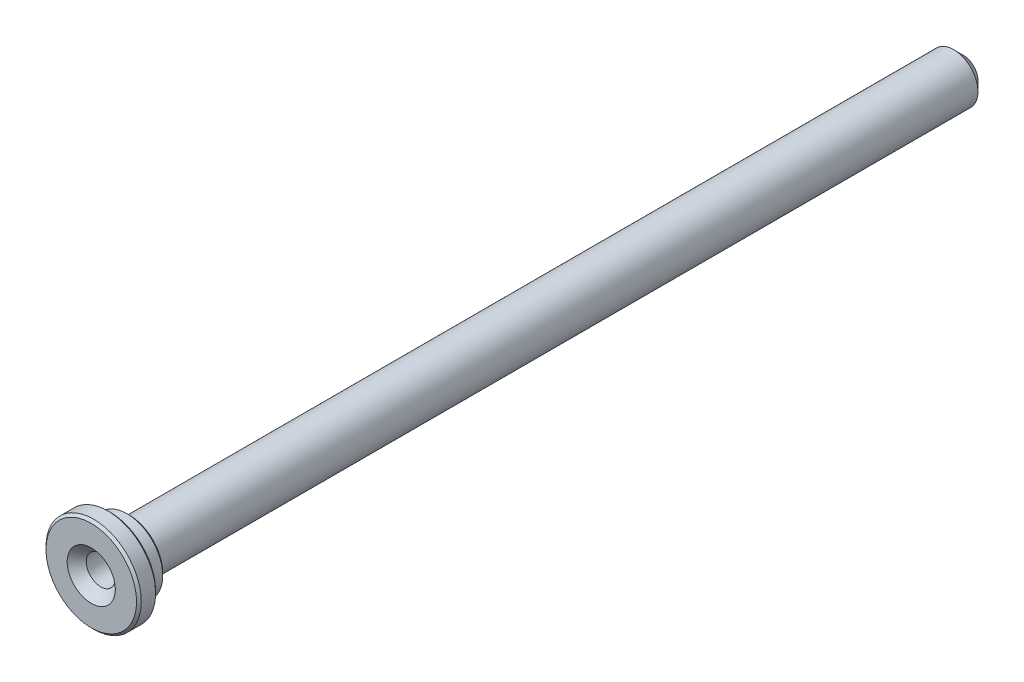
ISO-10303-21;
HEADER;
FILE_DESCRIPTION(('STEP AP214'),'2;1');
FILE_NAME('part.step','',(''),(''),'','','');
FILE_SCHEMA(('AUTOMOTIVE_DESIGN { 1 0 10303 214 1 1 1 1 }'));
ENDSEC;
DATA;
#1=APPLICATION_CONTEXT('core data for automotive mechanical design processes');
#2=APPLICATION_PROTOCOL_DEFINITION('international standard','automotive_design',2000,#1);
#3=PRODUCT_CONTEXT('',#1,'mechanical');
#4=PRODUCT('Part','Part','',(#3));
#5=PRODUCT_RELATED_PRODUCT_CATEGORY('part','',(#4));
#6=PRODUCT_DEFINITION_FORMATION('','',#4);
#7=PRODUCT_DEFINITION_CONTEXT('part definition',#1,'design');
#8=PRODUCT_DEFINITION('design','',#6,#7);
#9=PRODUCT_DEFINITION_SHAPE('','',#8);
#10=(LENGTH_UNIT() NAMED_UNIT(*) SI_UNIT(.MILLI.,.METRE.));
#11=(NAMED_UNIT(*) PLANE_ANGLE_UNIT() SI_UNIT($,.RADIAN.));
#12=(NAMED_UNIT(*) SI_UNIT($,.STERADIAN.) SOLID_ANGLE_UNIT());
#13=UNCERTAINTY_MEASURE_WITH_UNIT(LENGTH_MEASURE(1.E-05),#10,'distance_accuracy_value','');
#14=(GEOMETRIC_REPRESENTATION_CONTEXT(3) GLOBAL_UNCERTAINTY_ASSIGNED_CONTEXT((#13)) GLOBAL_UNIT_ASSIGNED_CONTEXT((#10,
#11,#12)) REPRESENTATION_CONTEXT('',''));
#15=CARTESIAN_POINT('',(0.,0.,0.));
#16=DIRECTION('',(0.,0.,1.));
#17=DIRECTION('',(1.,0.,0.));
#18=AXIS2_PLACEMENT_3D('',#15,#16,#17);
#19=CARTESIAN_POINT('',(0.,0.,0.));
#20=DIRECTION('',(0.,0.,-1.));
#21=DIRECTION('',(-1.,0.,0.));
#22=AXIS2_PLACEMENT_3D('',#19,#20,#21);
#23=PLANE('',#22);
#24=CARTESIAN_POINT('',(0.,0.,0.));
#25=DIRECTION('',(0.,0.,-1.));
#26=DIRECTION('',(-1.,0.,0.));
#27=AXIS2_PLACEMENT_3D('',#24,#25,#26);
#28=CIRCLE('',#27,3.10000000000002);
#29=CARTESIAN_POINT('',(-3.10000000000002,0.,0.));
#30=VERTEX_POINT('',#29);
#31=EDGE_CURVE('E63',#30,#30,#28,.T.);
#32=ORIENTED_EDGE('',*,*,#31,.T.);
#33=EDGE_LOOP('',(#32));
#34=FACE_BOUND('',#33,.T.);
#35=ADVANCED_FACE('F35',(#34),#23,.T.);
#36=CARTESIAN_POINT('',(0.,0.,0.));
#37=DIRECTION('',(0.,0.,-1.));
#38=DIRECTION('',(-1.,0.,0.));
#39=AXIS2_PLACEMENT_3D('',#36,#37,#38);
#40=CYLINDRICAL_SURFACE('',#39,5.1);
#41=CARTESIAN_POINT('',(0.,0.,1.99999999999997));
#42=DIRECTION('',(0.,0.,-1.));
#43=DIRECTION('',(-1.,0.,0.));
#44=AXIS2_PLACEMENT_3D('',#41,#42,#43);
#45=CIRCLE('',#44,5.1);
#46=CARTESIAN_POINT('',(-5.1,0.,1.99999999999997));
#47=VERTEX_POINT('',#46);
#48=EDGE_CURVE('E66',#47,#47,#45,.F.);
#49=ORIENTED_EDGE('',*,*,#48,.T.);
#50=EDGE_LOOP('',(#49));
#51=FACE_BOUND('',#50,.T.);
#52=CARTESIAN_POINT('',(0.,0.,175.));
#53=DIRECTION('',(0.,0.,-1.));
#54=DIRECTION('',(-1.,0.,0.));
#55=AXIS2_PLACEMENT_3D('',#52,#53,#54);
#56=CIRCLE('',#55,5.09999999999998);
#57=CARTESIAN_POINT('',(-5.09999999999998,0.,175.));
#58=VERTEX_POINT('',#57);
#59=EDGE_CURVE('E58',#58,#58,#56,.T.);
#60=ORIENTED_EDGE('',*,*,#59,.T.);
#61=EDGE_LOOP('',(#60));
#62=FACE_BOUND('',#61,.T.);
#63=ADVANCED_FACE('F112',(#51,#62),#40,.T.);
#64=CARTESIAN_POINT('',(0.,5.09999999999998,175.));
#65=DIRECTION('',(0.,0.,-1.));
#66=DIRECTION('',(-1.,0.,0.));
#67=AXIS2_PLACEMENT_3D('',#64,#65,#66);
#68=PLANE('',#67);
#69=CARTESIAN_POINT('',(0.,0.,175.));
#70=DIRECTION('',(0.,0.,-1.));
#71=DIRECTION('',(-1.,0.,0.));
#72=AXIS2_PLACEMENT_3D('',#69,#70,#71);
#73=CIRCLE('',#72,6.99999999999992);
#74=CARTESIAN_POINT('',(-6.99999999999992,0.,175.));
#75=VERTEX_POINT('',#74);
#76=EDGE_CURVE('E75',#75,#75,#73,.T.);
#77=ORIENTED_EDGE('',*,*,#76,.T.);
#78=EDGE_LOOP('',(#77));
#79=FACE_BOUND('',#78,.T.);
#80=ORIENTED_EDGE('',*,*,#59,.F.);
#81=EDGE_LOOP('',(#80));
#82=FACE_BOUND('',#81,.T.);
#83=ADVANCED_FACE('F106',(#79,#82),#68,.T.);
#84=CARTESIAN_POINT('',(0.,0.,0.));
#85=DIRECTION('',(0.,0.,-1.));
#86=DIRECTION('',(-1.,0.,0.));
#87=AXIS2_PLACEMENT_3D('',#84,#85,#86);
#88=CYLINDRICAL_SURFACE('',#87,7.49999999999998);
#89=CARTESIAN_POINT('',(0.,0.,175.5));
#90=DIRECTION('',(0.,0.,-1.));
#91=DIRECTION('',(-1.,0.,0.));
#92=AXIS2_PLACEMENT_3D('',#89,#90,#91);
#93=CIRCLE('',#92,7.49999999999998);
#94=CARTESIAN_POINT('',(-7.49999999999998,0.,175.5));
#95=VERTEX_POINT('',#94);
#96=EDGE_CURVE('E78',#95,#95,#93,.F.);
#97=ORIENTED_EDGE('',*,*,#96,.T.);
#98=EDGE_LOOP('',(#97));
#99=FACE_BOUND('',#98,.T.);
#100=CARTESIAN_POINT('',(0.,0.,179.));
#101=DIRECTION('',(0.,0.,-1.));
#102=DIRECTION('',(-1.,0.,0.));
#103=AXIS2_PLACEMENT_3D('',#100,#101,#102);
#104=CIRCLE('',#103,7.49999999999998);
#105=CARTESIAN_POINT('',(-7.49999999999998,0.,179.));
#106=VERTEX_POINT('',#105);
#107=EDGE_CURVE('E55',#106,#106,#104,.T.);
#108=ORIENTED_EDGE('',*,*,#107,.T.);
#109=EDGE_LOOP('',(#108));
#110=FACE_BOUND('',#109,.T.);
#111=ADVANCED_FACE('F101',(#99,#110),#88,.T.);
#112=CARTESIAN_POINT('',(0.,7.49999999999998,179.));
#113=DIRECTION('',(0.,0.,-1.));
#114=DIRECTION('',(-1.,0.,0.));
#115=AXIS2_PLACEMENT_3D('',#112,#113,#114);
#116=PLANE('',#115);
#117=CARTESIAN_POINT('',(0.,0.,179.));
#118=DIRECTION('',(0.,0.,-1.));
#119=DIRECTION('',(-1.,0.,0.));
#120=AXIS2_PLACEMENT_3D('',#117,#118,#119);
#121=CIRCLE('',#120,9.49999999999995);
#122=CARTESIAN_POINT('',(-9.49999999999995,0.,179.));
#123=VERTEX_POINT('',#122);
#124=EDGE_CURVE('E81',#123,#123,#121,.T.);
#125=ORIENTED_EDGE('',*,*,#124,.T.);
#126=EDGE_LOOP('',(#125));
#127=FACE_BOUND('',#126,.T.);
#128=ORIENTED_EDGE('',*,*,#107,.F.);
#129=EDGE_LOOP('',(#128));
#130=FACE_BOUND('',#129,.T.);
#131=ADVANCED_FACE('F98',(#127,#130),#116,.T.);
#132=CARTESIAN_POINT('',(0.,0.,0.));
#133=DIRECTION('',(0.,0.,-1.));
#134=DIRECTION('',(-1.,0.,0.));
#135=AXIS2_PLACEMENT_3D('',#132,#133,#134);
#136=CYLINDRICAL_SURFACE('',#135,9.99999999999998);
#137=CARTESIAN_POINT('',(0.,0.,179.5));
#138=DIRECTION('',(0.,0.,-1.));
#139=DIRECTION('',(-1.,0.,0.));
#140=AXIS2_PLACEMENT_3D('',#137,#138,#139);
#141=CIRCLE('',#140,9.99999999999998);
#142=CARTESIAN_POINT('',(-9.99999999999998,0.,179.5));
#143=VERTEX_POINT('',#142);
#144=EDGE_CURVE('E42',#143,#143,#141,.F.);
#145=ORIENTED_EDGE('',*,*,#144,.T.);
#146=EDGE_LOOP('',(#145));
#147=FACE_BOUND('',#146,.T.);
#148=CARTESIAN_POINT('',(0.,0.,182.5));
#149=DIRECTION('',(0.,0.,1.));
#150=DIRECTION('',(1.,0.,0.));
#151=AXIS2_PLACEMENT_3D('',#148,#149,#150);
#152=CIRCLE('',#151,9.99999999999998);
#153=CARTESIAN_POINT('',(9.99999999999998,0.,182.5));
#154=VERTEX_POINT('',#153);
#155=EDGE_CURVE('E84',#154,#154,#152,.F.);
#156=ORIENTED_EDGE('',*,*,#155,.T.);
#157=EDGE_LOOP('',(#156));
#158=FACE_BOUND('',#157,.T.);
#159=ADVANCED_FACE('F89',(#147,#158),#136,.T.);
#160=CARTESIAN_POINT('',(0.,9.99999999999998,183.));
#161=DIRECTION('',(0.,0.,1.));
#162=DIRECTION('',(1.,0.,0.));
#163=AXIS2_PLACEMENT_3D('',#160,#161,#162);
#164=PLANE('',#163);
#165=CARTESIAN_POINT('',(0.,0.,183.));
#166=DIRECTION('',(0.,0.,1.));
#167=DIRECTION('',(1.,0.,0.));
#168=AXIS2_PLACEMENT_3D('',#165,#166,#167);
#169=CIRCLE('',#168,9.49999999999993);
#170=CARTESIAN_POINT('',(9.49999999999993,0.,183.));
#171=VERTEX_POINT('',#170);
#172=EDGE_CURVE('E11',#171,#171,#169,.T.);
#173=ORIENTED_EDGE('',*,*,#172,.T.);
#174=EDGE_LOOP('',(#173));
#175=FACE_BOUND('',#174,.T.);
#176=CARTESIAN_POINT('',(0.,0.,183.));
#177=DIRECTION('',(0.,0.,1.));
#178=DIRECTION('',(1.,0.,0.));
#179=AXIS2_PLACEMENT_3D('',#176,#177,#178);
#180=CIRCLE('',#179,5.05);
#181=CARTESIAN_POINT('',(5.05,0.,183.));
#182=VERTEX_POINT('',#181);
#183=EDGE_CURVE('E69',#182,#182,#180,.F.);
#184=ORIENTED_EDGE('',*,*,#183,.T.);
#185=EDGE_LOOP('',(#184));
#186=FACE_BOUND('',#185,.T.);
#187=ADVANCED_FACE('F183',(#175,#186),#164,.T.);
#188=CARTESIAN_POINT('',(0.,0.,0.));
#189=DIRECTION('',(0.,0.,-1.));
#190=DIRECTION('',(-1.,0.,0.));
#191=AXIS2_PLACEMENT_3D('',#188,#189,#190);
#192=CYLINDRICAL_SURFACE('',#191,3.04999999999999);
#193=CARTESIAN_POINT('',(0.,0.,181.));
#194=DIRECTION('',(0.,0.,1.));
#195=DIRECTION('',(1.,0.,0.));
#196=AXIS2_PLACEMENT_3D('',#193,#194,#195);
#197=CIRCLE('',#196,3.04999999999999);
#198=CARTESIAN_POINT('',(3.04999999999999,0.,181.));
#199=VERTEX_POINT('',#198);
#200=EDGE_CURVE('E72',#199,#199,#197,.T.);
#201=ORIENTED_EDGE('',*,*,#200,.T.);
#202=EDGE_LOOP('',(#201));
#203=FACE_BOUND('',#202,.T.);
#204=CARTESIAN_POINT('',(0.,0.,143.));
#205=DIRECTION('',(0.,0.,-1.));
#206=DIRECTION('',(-1.,0.,0.));
#207=AXIS2_PLACEMENT_3D('',#204,#205,#206);
#208=CIRCLE('',#207,3.04999999999998);
#209=CARTESIAN_POINT('',(-3.04999999999998,0.,143.));
#210=VERTEX_POINT('',#209);
#211=EDGE_CURVE('E53',#210,#210,#208,.T.);
#212=ORIENTED_EDGE('',*,*,#211,.T.);
#213=EDGE_LOOP('',(#212));
#214=FACE_BOUND('',#213,.T.);
#215=ADVANCED_FACE('F49',(#203,#214),#192,.F.);
#216=CARTESIAN_POINT('',(0.,0.,143.));
#217=DIRECTION('',(0.,0.,1.));
#218=DIRECTION('',(1.,0.,0.));
#219=AXIS2_PLACEMENT_3D('',#216,#217,#218);
#220=CONICAL_SURFACE('',#219,3.04999999999998,0.940973732060446);
#221=CARTESIAN_POINT('',(0.,0.,140.777028700536));
#222=VERTEX_POINT('',#221);
#223=VERTEX_LOOP('',#222);
#224=FACE_BOUND('',#223,.T.);
#225=ORIENTED_EDGE('',*,*,#211,.F.);
#226=EDGE_LOOP('',(#225));
#227=FACE_BOUND('',#226,.T.);
#228=ADVANCED_FACE('F45',(#224,#227),#220,.F.);
#229=CARTESIAN_POINT('',(0.,0.,0.));
#230=DIRECTION('',(0.,0.,1.));
#231=DIRECTION('',(1.,0.,0.));
#232=AXIS2_PLACEMENT_3D('',#229,#230,#231);
#233=CONICAL_SURFACE('',#232,3.10000000000002,0.785398163397451);
#234=ORIENTED_EDGE('',*,*,#48,.F.);
#235=EDGE_LOOP('',(#234));
#236=FACE_BOUND('',#235,.T.);
#237=ORIENTED_EDGE('',*,*,#31,.F.);
#238=EDGE_LOOP('',(#237));
#239=FACE_BOUND('',#238,.T.);
#240=ADVANCED_FACE('F48',(#236,#239),#233,.T.);
#241=CARTESIAN_POINT('',(0.,0.,183.));
#242=DIRECTION('',(0.,0.,1.));
#243=DIRECTION('',(1.,0.,0.));
#244=AXIS2_PLACEMENT_3D('',#241,#242,#243);
#245=CONICAL_SURFACE('',#244,5.05,0.785398163397451);
#246=ORIENTED_EDGE('',*,*,#200,.F.);
#247=EDGE_LOOP('',(#246));
#248=FACE_BOUND('',#247,.T.);
#249=ORIENTED_EDGE('',*,*,#183,.F.);
#250=EDGE_LOOP('',(#249));
#251=FACE_BOUND('',#250,.T.);
#252=ADVANCED_FACE('F126',(#248,#251),#245,.F.);
#253=CARTESIAN_POINT('',(0.,0.,175.));
#254=DIRECTION('',(0.,0.,1.));
#255=DIRECTION('',(1.,0.,0.));
#256=AXIS2_PLACEMENT_3D('',#253,#254,#255);
#257=CONICAL_SURFACE('',#256,6.99999999999992,0.785398163397447);
#258=ORIENTED_EDGE('',*,*,#96,.F.);
#259=EDGE_LOOP('',(#258));
#260=FACE_BOUND('',#259,.T.);
#261=ORIENTED_EDGE('',*,*,#76,.F.);
#262=EDGE_LOOP('',(#261));
#263=FACE_BOUND('',#262,.T.);
#264=ADVANCED_FACE('F95',(#260,#263),#257,.T.);
#265=CARTESIAN_POINT('',(0.,0.,179.));
#266=DIRECTION('',(0.,0.,1.));
#267=DIRECTION('',(1.,0.,0.));
#268=AXIS2_PLACEMENT_3D('',#265,#266,#267);
#269=CONICAL_SURFACE('',#268,9.49999999999995,0.785398163397474);
#270=ORIENTED_EDGE('',*,*,#144,.F.);
#271=EDGE_LOOP('',(#270));
#272=FACE_BOUND('',#271,.T.);
#273=ORIENTED_EDGE('',*,*,#124,.F.);
#274=EDGE_LOOP('',(#273));
#275=FACE_BOUND('',#274,.T.);
#276=ADVANCED_FACE('F92',(#272,#275),#269,.T.);
#277=CARTESIAN_POINT('',(0.,0.,182.5));
#278=DIRECTION('',(0.,0.,-1.));
#279=DIRECTION('',(-1.,0.,0.));
#280=AXIS2_PLACEMENT_3D('',#277,#278,#279);
#281=CONICAL_SURFACE('',#280,9.99999999999998,0.785398163397447);
#282=ORIENTED_EDGE('',*,*,#172,.F.);
#283=EDGE_LOOP('',(#282));
#284=FACE_BOUND('',#283,.T.);
#285=ORIENTED_EDGE('',*,*,#155,.F.);
#286=EDGE_LOOP('',(#285));
#287=FACE_BOUND('',#286,.T.);
#288=ADVANCED_FACE('F37',(#284,#287),#281,.T.);
#289=CLOSED_SHELL('',(#35,#63,#83,#111,#131,#159,#187,#215,#228,#240,#252,#264,#276,#288));
#290=MANIFOLD_SOLID_BREP('B2',#289);
#291=ADVANCED_BREP_SHAPE_REPRESENTATION('',(#18,#290),#14);
#292=SHAPE_DEFINITION_REPRESENTATION(#9,#291);
ENDSEC;
END-ISO-10303-21;
